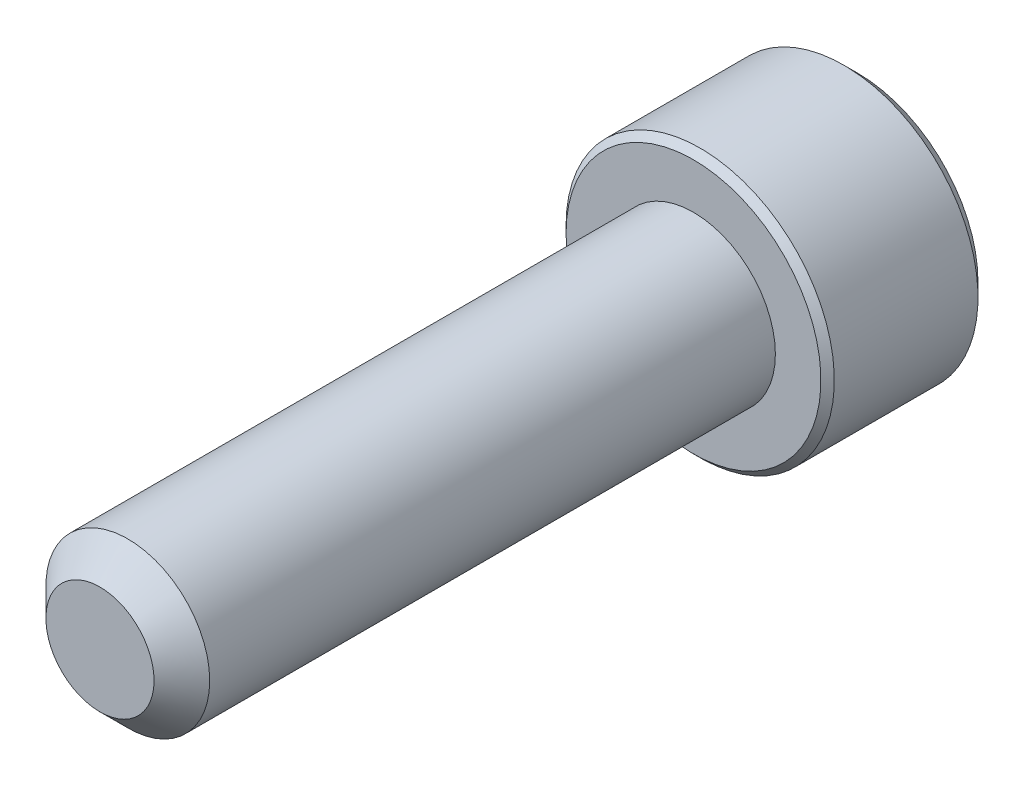
ISO-10303-21;
HEADER;
FILE_DESCRIPTION(('STEP AP214'),'2;1');
FILE_NAME('part.step','',(''),(''),'','','');
FILE_SCHEMA(('AUTOMOTIVE_DESIGN { 1 0 10303 214 1 1 1 1 }'));
ENDSEC;
DATA;
#1=APPLICATION_CONTEXT('core data for automotive mechanical design processes');
#2=APPLICATION_PROTOCOL_DEFINITION('international standard','automotive_design',2000,#1);
#3=PRODUCT_CONTEXT('',#1,'mechanical');
#4=PRODUCT('Part','Part','',(#3));
#5=PRODUCT_RELATED_PRODUCT_CATEGORY('part','',(#4));
#6=PRODUCT_DEFINITION_FORMATION('','',#4);
#7=PRODUCT_DEFINITION_CONTEXT('part definition',#1,'design');
#8=PRODUCT_DEFINITION('design','',#6,#7);
#9=PRODUCT_DEFINITION_SHAPE('','',#8);
#10=(LENGTH_UNIT() NAMED_UNIT(*) SI_UNIT(.MILLI.,.METRE.));
#11=(NAMED_UNIT(*) PLANE_ANGLE_UNIT() SI_UNIT($,.RADIAN.));
#12=(NAMED_UNIT(*) SI_UNIT($,.STERADIAN.) SOLID_ANGLE_UNIT());
#13=UNCERTAINTY_MEASURE_WITH_UNIT(LENGTH_MEASURE(1.E-05),#10,'distance_accuracy_value','');
#14=(GEOMETRIC_REPRESENTATION_CONTEXT(3) GLOBAL_UNCERTAINTY_ASSIGNED_CONTEXT((#13)) GLOBAL_UNIT_ASSIGNED_CONTEXT((#10,
#11,#12)) REPRESENTATION_CONTEXT('',''));
#15=CARTESIAN_POINT('',(0.,0.,0.));
#16=DIRECTION('',(0.,0.,1.));
#17=DIRECTION('',(1.,0.,0.));
#18=AXIS2_PLACEMENT_3D('',#15,#16,#17);
#19=CARTESIAN_POINT('',(0.,0.,-12.7));
#20=DIRECTION('',(0.,0.,1.));
#21=DIRECTION('',(1.,0.,0.));
#22=AXIS2_PLACEMENT_3D('',#19,#20,#21);
#23=CYLINDRICAL_SURFACE('',#22,1.7526);
#24=CARTESIAN_POINT('',(0.,0.,-0.595312500000002));
#25=DIRECTION('',(0.,0.,1.));
#26=DIRECTION('',(1.,0.,0.));
#27=AXIS2_PLACEMENT_3D('',#24,#25,#26);
#28=CIRCLE('',#27,1.7526);
#29=CARTESIAN_POINT('',(1.7526,0.,-0.595312500000002));
#30=VERTEX_POINT('',#29);
#31=EDGE_CURVE('E106',#30,#30,#28,.F.);
#32=ORIENTED_EDGE('',*,*,#31,.T.);
#33=EDGE_LOOP('',(#32));
#34=FACE_BOUND('',#33,.T.);
#35=CARTESIAN_POINT('',(0.,0.,-12.7));
#36=DIRECTION('',(0.,0.,-1.));
#37=DIRECTION('',(-1.,0.,0.));
#38=AXIS2_PLACEMENT_3D('',#35,#36,#37);
#39=CIRCLE('',#38,1.7526);
#40=CARTESIAN_POINT('',(-1.7526,0.,-12.7));
#41=VERTEX_POINT('',#40);
#42=EDGE_CURVE('E206',#41,#41,#39,.F.);
#43=ORIENTED_EDGE('',*,*,#42,.T.);
#44=EDGE_LOOP('',(#43));
#45=FACE_BOUND('',#44,.T.);
#46=ADVANCED_FACE('F32',(#34,#45),#23,.T.);
#47=CARTESIAN_POINT('',(0.,0.,0.));
#48=DIRECTION('',(0.,0.,1.));
#49=DIRECTION('',(1.,0.,0.));
#50=AXIS2_PLACEMENT_3D('',#47,#48,#49);
#51=PLANE('',#50);
#52=CARTESIAN_POINT('',(0.,0.,0.));
#53=DIRECTION('',(0.,0.,1.));
#54=DIRECTION('',(1.,0.,0.));
#55=AXIS2_PLACEMENT_3D('',#52,#53,#54);
#56=CIRCLE('',#55,1.1572875);
#57=CARTESIAN_POINT('',(1.1572875,0.,0.));
#58=VERTEX_POINT('',#57);
#59=EDGE_CURVE('E205',#58,#58,#56,.T.);
#60=ORIENTED_EDGE('',*,*,#59,.T.);
#61=EDGE_LOOP('',(#60));
#62=FACE_BOUND('',#61,.T.);
#63=ADVANCED_FACE('F183',(#62),#51,.T.);
#64=CARTESIAN_POINT('',(0.,0.,0.));
#65=DIRECTION('',(0.,0.,-1.));
#66=DIRECTION('',(-1.,0.,0.));
#67=AXIS2_PLACEMENT_3D('',#64,#65,#66);
#68=CONICAL_SURFACE('',#67,1.1572875,0.785398163397447);
#69=ORIENTED_EDGE('',*,*,#31,.F.);
#70=EDGE_LOOP('',(#69));
#71=FACE_BOUND('',#70,.T.);
#72=ORIENTED_EDGE('',*,*,#59,.F.);
#73=EDGE_LOOP('',(#72));
#74=FACE_BOUND('',#73,.T.);
#75=ADVANCED_FACE('F189',(#71,#74),#68,.T.);
#76=CARTESIAN_POINT('',(0.,0.,-16.2052));
#77=DIRECTION('',(0.,0.,1.));
#78=DIRECTION('',(1.,0.,0.));
#79=AXIS2_PLACEMENT_3D('',#76,#77,#78);
#80=CYLINDRICAL_SURFACE('',#79,2.8702);
#81=CARTESIAN_POINT('',(0.,0.,-12.84351));
#82=DIRECTION('',(0.,0.,-1.));
#83=DIRECTION('',(-1.,0.,0.));
#84=AXIS2_PLACEMENT_3D('',#81,#82,#83);
#85=CIRCLE('',#84,2.8702);
#86=CARTESIAN_POINT('',(-2.8702,0.,-12.84351));
#87=VERTEX_POINT('',#86);
#88=EDGE_CURVE('E40',#87,#87,#85,.T.);
#89=ORIENTED_EDGE('',*,*,#88,.T.);
#90=EDGE_LOOP('',(#89));
#91=FACE_BOUND('',#90,.T.);
#92=CARTESIAN_POINT('',(0.,0.,-15.91818));
#93=DIRECTION('',(0.,0.,-1.));
#94=DIRECTION('',(-1.,0.,0.));
#95=AXIS2_PLACEMENT_3D('',#92,#93,#94);
#96=CIRCLE('',#95,2.8702);
#97=CARTESIAN_POINT('',(-2.8702,0.,-15.91818));
#98=VERTEX_POINT('',#97);
#99=EDGE_CURVE('E166',#98,#98,#96,.F.);
#100=ORIENTED_EDGE('',*,*,#99,.T.);
#101=EDGE_LOOP('',(#100));
#102=FACE_BOUND('',#101,.T.);
#103=ADVANCED_FACE('F171',(#91,#102),#80,.T.);
#104=CARTESIAN_POINT('',(0.,0.,-16.2052));
#105=DIRECTION('',(0.,0.,-1.));
#106=DIRECTION('',(-1.,0.,0.));
#107=AXIS2_PLACEMENT_3D('',#104,#105,#106);
#108=PLANE('',#107);
#109=CARTESIAN_POINT('',(0.,0.,-16.2052));
#110=DIRECTION('',(0.,0.,-1.));
#111=DIRECTION('',(-1.,0.,0.));
#112=AXIS2_PLACEMENT_3D('',#109,#110,#111);
#113=CIRCLE('',#112,2.58318);
#114=CARTESIAN_POINT('',(-2.58318,0.,-16.2052));
#115=VERTEX_POINT('',#114);
#116=EDGE_CURVE('E105',#115,#115,#113,.T.);
#117=ORIENTED_EDGE('',*,*,#116,.T.);
#118=EDGE_LOOP('',(#117));
#119=FACE_BOUND('',#118,.T.);
#120=CARTESIAN_POINT('',(0.,0.,-16.2052));
#121=DIRECTION('',(0.,0.,-1.));
#122=DIRECTION('',(-1.,0.,0.));
#123=AXIS2_PLACEMENT_3D('',#120,#121,#122);
#124=CIRCLE('',#123,1.60395121659243);
#125=CARTESIAN_POINT('',(-1.3890625,0.801975608296215,-16.2052));
#126=VERTEX_POINT('',#125);
#127=CARTESIAN_POINT('',(0.,1.60395121659243,-16.2052));
#128=VERTEX_POINT('',#127);
#129=EDGE_CURVE('E86',#126,#128,#124,.T.);
#130=ORIENTED_EDGE('',*,*,#129,.F.);
#131=CARTESIAN_POINT('',(-1.3890625,-0.801975608296215,-16.2052));
#132=VERTEX_POINT('',#131);
#133=EDGE_CURVE('E46',#132,#126,#124,.T.);
#134=ORIENTED_EDGE('',*,*,#133,.F.);
#135=CARTESIAN_POINT('',(0.,-1.60395121659243,-16.2052));
#136=VERTEX_POINT('',#135);
#137=EDGE_CURVE('E262',#136,#132,#124,.T.);
#138=ORIENTED_EDGE('',*,*,#137,.F.);
#139=CARTESIAN_POINT('',(1.3890625,-0.801975608296214,-16.2052));
#140=VERTEX_POINT('',#139);
#141=EDGE_CURVE('E53',#140,#136,#124,.T.);
#142=ORIENTED_EDGE('',*,*,#141,.F.);
#143=CARTESIAN_POINT('',(1.3890625,0.801975608296215,-16.2052));
#144=VERTEX_POINT('',#143);
#145=EDGE_CURVE('E127',#144,#140,#124,.T.);
#146=ORIENTED_EDGE('',*,*,#145,.F.);
#147=EDGE_CURVE('E95',#128,#144,#124,.T.);
#148=ORIENTED_EDGE('',*,*,#147,.F.);
#149=EDGE_LOOP('',(#130,#134,#138,#142,#146,#148));
#150=FACE_BOUND('',#149,.T.);
#151=ADVANCED_FACE('F126',(#119,#150),#108,.T.);
#152=CARTESIAN_POINT('',(0.,0.,-12.7));
#153=DIRECTION('',(0.,0.,-1.));
#154=DIRECTION('',(-1.,0.,0.));
#155=AXIS2_PLACEMENT_3D('',#152,#153,#154);
#156=PLANE('',#155);
#157=CARTESIAN_POINT('',(0.,0.,-12.7));
#158=DIRECTION('',(0.,0.,-1.));
#159=DIRECTION('',(-1.,0.,0.));
#160=AXIS2_PLACEMENT_3D('',#157,#158,#159);
#161=CIRCLE('',#160,2.72669);
#162=CARTESIAN_POINT('',(-2.72669,0.,-12.7));
#163=VERTEX_POINT('',#162);
#164=EDGE_CURVE('E11',#163,#163,#161,.F.);
#165=ORIENTED_EDGE('',*,*,#164,.T.);
#166=EDGE_LOOP('',(#165));
#167=FACE_BOUND('',#166,.T.);
#168=ORIENTED_EDGE('',*,*,#42,.F.);
#169=EDGE_LOOP('',(#168));
#170=FACE_BOUND('',#169,.T.);
#171=ADVANCED_FACE('F274',(#167,#170),#156,.F.);
#172=CARTESIAN_POINT('',(0.,0.,-16.2052));
#173=DIRECTION('',(0.,0.,-1.));
#174=DIRECTION('',(-1.,0.,0.));
#175=AXIS2_PLACEMENT_3D('',#172,#173,#174);
#176=CONICAL_SURFACE('',#175,1.60395121659243,0.78539816339745);
#177=ORIENTED_EDGE('',*,*,#147,.T.);
#178=CARTESIAN_POINT('',(-0.000200000000000435,1.60406668664627,-16.2053154825221));
#179=CARTESIAN_POINT('',(0.0475548148995853,1.57649543140889,-16.177764786881));
#180=CARTESIAN_POINT('',(0.0961082129767672,1.54846311395896,-16.1518319141145));
#181=CARTESIAN_POINT('',(0.195114281423185,1.49130193369001,-16.1043489608708));
#182=CARTESIAN_POINT('',(0.245576372730142,1.46216763169007,-16.0828253080794));
#183=CARTESIAN_POINT('',(0.347330835284912,1.40341966534283,-16.0459546019866));
#184=CARTESIAN_POINT('',(0.398597278416378,1.37382097060048,-16.0305148513149));
#185=CARTESIAN_POINT('',(0.502259069123941,1.31397180783079,-16.0067264581829));
#186=CARTESIAN_POINT('',(0.554651247789435,1.28372316937484,-15.9983600517165));
#187=CARTESIAN_POINT('',(0.644944084544838,1.23159257576821,-15.9908113663708));
#188=CARTESIAN_POINT('',(0.682728034255604,1.20977800223165,-15.9896936971037));
#189=CARTESIAN_POINT('',(0.758229287800441,1.16618733317339,-15.9915750513552));
#190=CARTESIAN_POINT('',(0.795946575086522,1.14441124720566,-15.9945749834252));
#191=CARTESIAN_POINT('',(0.871018018906524,1.10106872890773,-16.0045189567457));
#192=CARTESIAN_POINT('',(0.908371804329557,1.07950251083849,-16.0114666704902));
#193=CARTESIAN_POINT('',(0.982452435596044,1.03673203843505,-16.0289288810594));
#194=CARTESIAN_POINT('',(1.01917900521513,1.01552794357906,-16.0394449088769));
#195=CARTESIAN_POINT('',(1.11325413716704,0.961213640822575,-16.0706664203823));
#196=CARTESIAN_POINT('',(1.17001916310317,0.928440337817792,-16.0937263608604));
#197=CARTESIAN_POINT('',(1.25348479270274,0.880251434100401,-16.1326547118294));
#198=CARTESIAN_POINT('',(1.28098915116073,0.864371785340789,-16.1463318145832));
#199=CARTESIAN_POINT('',(1.33549195495674,0.832904576897576,-16.1749348081189));
#200=CARTESIAN_POINT('',(1.36249063449213,0.817316882000056,-16.1898601023926));
#201=CARTESIAN_POINT('',(1.3892625,0.801860138242377,-16.2053154825221));
#202=B_SPLINE_CURVE_WITH_KNOTS('',3,(#178,#179,#180,#181,#182,#183,#184,#185,#186,#187,#188,
#189,#190,#191,#192,#193,#194,#195,#196,#197,#198,#199,#200,#201),.UNSPECIFIED.,.F.,.F.,(4,2,2,
2,2,2,2,2,2,2,2,4),(0.,0.185054161583334,0.37118697473197,0.554362620151557,0.737076859824678,
0.867821902366112,0.998595798526823,1.12949154907137,1.26044353188445,1.46846066168042,
1.57218026599104,1.67585058309997),.UNSPECIFIED.);
#203=EDGE_CURVE('E100',#128,#144,#202,.T.);
#204=ORIENTED_EDGE('',*,*,#203,.F.);
#205=EDGE_LOOP('',(#177,#204));
#206=FACE_BOUND('',#205,.T.);
#207=ADVANCED_FACE('F101',(#206),#176,.F.);
#208=ORIENTED_EDGE('',*,*,#145,.T.);
#209=CARTESIAN_POINT('',(1.3890625,-1.59946669533747,-16.7196888553473));
#210=CARTESIAN_POINT('',(1.3890625,-1.56052074100157,-16.6902883204447));
#211=CARTESIAN_POINT('',(1.3890625,-1.52135778101398,-16.6611760571059));
#212=CARTESIAN_POINT('',(1.3890625,-1.44250974368035,-16.6036471018554));
#213=CARTESIAN_POINT('',(1.3890625,-1.40282453775616,-16.5752305863579));
#214=CARTESIAN_POINT('',(1.3890625,-1.28227261747607,-16.4907979106091));
#215=CARTESIAN_POINT('',(1.3890625,-1.20050167441144,-16.4360513931364));
#216=CARTESIAN_POINT('',(1.3890625,-1.0290311937974,-16.3285774539605));
#217=CARTESIAN_POINT('',(1.3890625,-0.939145510476105,-16.2761436435155));
#218=CARTESIAN_POINT('',(1.3890625,-0.754884542278014,-16.1802310286316));
#219=CARTESIAN_POINT('',(1.3890625,-0.660525767721077,-16.1367220353823));
#220=CARTESIAN_POINT('',(1.3890625,-0.518892422901336,-16.0834928148428));
#221=CARTESIAN_POINT('',(1.3890625,-0.47371474679442,-16.0682156455446));
#222=CARTESIAN_POINT('',(1.3890625,-0.382268722235191,-16.0412883218985));
#223=CARTESIAN_POINT('',(1.3890625,-0.336000298881662,-16.0296384174186));
#224=CARTESIAN_POINT('',(1.3890625,-0.243422308835822,-16.0107647672582));
#225=CARTESIAN_POINT('',(1.3890625,-0.197128447486237,-16.0034651868372));
#226=CARTESIAN_POINT('',(1.3890625,-0.104045636784196,-15.993434703163));
#227=CARTESIAN_POINT('',(1.3890625,-0.057256773928491,-15.9907030145629));
#228=CARTESIAN_POINT('',(1.3890625,0.0346588401718113,-15.9900109514094));
#229=CARTESIAN_POINT('',(1.3890625,0.0797843745088195,-15.9918812460884));
#230=CARTESIAN_POINT('',(1.3890625,0.16965302260521,-15.9999168656859));
#231=CARTESIAN_POINT('',(1.3890625,0.214396061393215,-16.0060830139257));
#232=CARTESIAN_POINT('',(1.3890625,0.303926740576743,-16.0224783142406));
#233=CARTESIAN_POINT('',(1.3890625,0.348701560562638,-16.0327764230037));
#234=CARTESIAN_POINT('',(1.3890625,0.43727288980183,-16.0568883282636));
#235=CARTESIAN_POINT('',(1.3890625,0.481069480580727,-16.0707018305893));
#236=CARTESIAN_POINT('',(1.3890625,0.618958177531066,-16.1193885558667));
#237=CARTESIAN_POINT('',(1.3890625,0.711087679809603,-16.1598066296314));
#238=CARTESIAN_POINT('',(1.3890625,0.891018647016394,-16.2496712938188));
#239=CARTESIAN_POINT('',(1.3890625,0.978803075143678,-16.2991503209353));
#240=CARTESIAN_POINT('',(1.3890625,1.14657176186197,-16.4012299189673));
#241=CARTESIAN_POINT('',(1.3890625,1.22672686003424,-16.4535531888122));
#242=CARTESIAN_POINT('',(1.3890625,1.34481925924246,-16.5344395512885));
#243=CARTESIAN_POINT('',(1.3890625,1.3836737146102,-16.5616868720938));
#244=CARTESIAN_POINT('',(1.3890625,1.46085170378018,-16.6169021635328));
#245=CARTESIAN_POINT('',(1.3890625,1.49917537967344,-16.6448699353332));
#246=CARTESIAN_POINT('',(1.3890625,1.53727804285926,-16.6731364275532));
#247=B_SPLINE_CURVE_WITH_KNOTS('',3,(#209,#210,#211,#212,#213,#214,#215,#216,#217,#218,#219,
#220,#221,#222,#223,#224,#225,#226,#227,#228,#229,#230,#231,#232,#233,#234,#235,#236,#237,#238,
#239,#240,#241,#242,#243,#244,#245,#246),.UNSPECIFIED.,.F.,.F.,(4,2,2,2,2,2,2,2,2,2,2,2,2,2,2,2,
2,2,4),(0.,0.146388252251748,0.292813246205362,0.587897938676555,0.899825715593291,
1.21068031322194,1.35363178607713,1.49659310411811,1.63698331439609,1.77734938523477,
1.91262840625218,2.04793336128669,2.18559709790565,2.32324931849741,2.62418012481466,
2.92621005486572,3.2132312503121,3.35559422447358,3.49791832091463),.UNSPECIFIED.);
#248=EDGE_CURVE('E94',#144,#140,#247,.F.);
#249=ORIENTED_EDGE('',*,*,#248,.F.);
#250=EDGE_LOOP('',(#208,#249));
#251=FACE_BOUND('',#250,.T.);
#252=ADVANCED_FACE('F268',(#251),#176,.F.);
#253=ORIENTED_EDGE('',*,*,#141,.T.);
#254=CARTESIAN_POINT('',(1.3892625,-0.801860138242377,-16.2053154825221));
#255=CARTESIAN_POINT('',(1.34150768510041,-0.829431393479753,-16.177764786881));
#256=CARTESIAN_POINT('',(1.29295428702323,-0.857463710929685,-16.1518319141145));
#257=CARTESIAN_POINT('',(1.19394821857682,-0.914624891198629,-16.1043489608708));
#258=CARTESIAN_POINT('',(1.14348612726986,-0.943759193198572,-16.0828253080794));
#259=CARTESIAN_POINT('',(1.04173166471509,-1.00250715954581,-16.0459546019866));
#260=CARTESIAN_POINT('',(0.990465221583627,-1.03210585428816,-16.0305148513149));
#261=CARTESIAN_POINT('',(0.886803430876065,-1.09195501705785,-16.0067264581829));
#262=CARTESIAN_POINT('',(0.834411252210571,-1.1222036555138,-15.9983600517165));
#263=CARTESIAN_POINT('',(0.744118415455169,-1.17433424912043,-15.9908113663708));
#264=CARTESIAN_POINT('',(0.706334465744403,-1.19614882265699,-15.9896936971037));
#265=CARTESIAN_POINT('',(0.630833212199567,-1.23973949171525,-15.9915750513552));
#266=CARTESIAN_POINT('',(0.593115924913486,-1.26151557768297,-15.9945749834252));
#267=CARTESIAN_POINT('',(0.518044481093484,-1.30485809598091,-16.0045189567457));
#268=CARTESIAN_POINT('',(0.480690695670451,-1.32642431405015,-16.0114666704902));
#269=CARTESIAN_POINT('',(0.406610064403964,-1.36919478645359,-16.0289288810594));
#270=CARTESIAN_POINT('',(0.369883494784876,-1.39039888130958,-16.0394449088769));
#271=CARTESIAN_POINT('',(0.275808362832969,-1.44471318406606,-16.0706664203823));
#272=CARTESIAN_POINT('',(0.219043336896834,-1.47748648707085,-16.0937263608604));
#273=CARTESIAN_POINT('',(0.135577707297265,-1.52567539078824,-16.1326547118294));
#274=CARTESIAN_POINT('',(0.108073348839269,-1.54155503954785,-16.1463318145832));
#275=CARTESIAN_POINT('',(0.0535705450432627,-1.57302224799107,-16.1749348081189));
#276=CARTESIAN_POINT('',(0.0265718655078742,-1.58860994288859,-16.1898601023926));
#277=CARTESIAN_POINT('',(-0.000199999999998967,-1.60406668664627,-16.2053154825221));
#278=B_SPLINE_CURVE_WITH_KNOTS('',3,(#254,#255,#256,#257,#258,#259,#260,#261,#262,#263,#264,
#265,#266,#267,#268,#269,#270,#271,#272,#273,#274,#275,#276,#277),.UNSPECIFIED.,.F.,.F.,(4,2,2,
2,2,2,2,2,2,2,2,4),(0.,0.185054161583328,0.371186974731961,0.554362620151548,0.737076859824666,
0.8678219023661,0.998595798526811,1.12949154907136,1.26044353188443,1.46846066168041,
1.57218026599103,1.67585058309997),.UNSPECIFIED.);
#279=EDGE_CURVE('E136',#140,#136,#278,.T.);
#280=ORIENTED_EDGE('',*,*,#279,.F.);
#281=EDGE_LOOP('',(#253,#280));
#282=FACE_BOUND('',#281,.T.);
#283=ADVANCED_FACE('F265',(#282),#176,.F.);
#284=ORIENTED_EDGE('',*,*,#137,.T.);
#285=CARTESIAN_POINT('',(0.000200000000000775,-1.60406668664627,-16.2053154825221));
#286=CARTESIAN_POINT('',(-0.0475548148995849,-1.57649543140889,-16.177764786881));
#287=CARTESIAN_POINT('',(-0.0961082129767667,-1.54846311395896,-16.1518319141145));
#288=CARTESIAN_POINT('',(-0.195114281423184,-1.49130193369001,-16.1043489608708));
#289=CARTESIAN_POINT('',(-0.245576372730141,-1.46216763169007,-16.0828253080794));
#290=CARTESIAN_POINT('',(-0.347330835284911,-1.40341966534283,-16.0459546019866));
#291=CARTESIAN_POINT('',(-0.398597278416377,-1.37382097060048,-16.0305148513149));
#292=CARTESIAN_POINT('',(-0.50225906912394,-1.31397180783079,-16.0067264581829));
#293=CARTESIAN_POINT('',(-0.554651247789434,-1.28372316937484,-15.9983600517165));
#294=CARTESIAN_POINT('',(-0.644944084544837,-1.23159257576821,-15.9908113663708));
#295=CARTESIAN_POINT('',(-0.682728034255603,-1.20977800223165,-15.9896936971037));
#296=CARTESIAN_POINT('',(-0.75822928780044,-1.16618733317339,-15.9915750513552));
#297=CARTESIAN_POINT('',(-0.79594657508652,-1.14441124720567,-15.9945749834252));
#298=CARTESIAN_POINT('',(-0.871018018906523,-1.10106872890773,-16.0045189567457));
#299=CARTESIAN_POINT('',(-0.908371804329556,-1.07950251083849,-16.0114666704902));
#300=CARTESIAN_POINT('',(-0.982452435596043,-1.03673203843505,-16.0289288810594));
#301=CARTESIAN_POINT('',(-1.01917900521513,-1.01552794357906,-16.0394449088769));
#302=CARTESIAN_POINT('',(-1.11325413716704,-0.961213640822576,-16.0706664203823));
#303=CARTESIAN_POINT('',(-1.17001916310317,-0.928440337817793,-16.0937263608604));
#304=CARTESIAN_POINT('',(-1.25348479270274,-0.880251434100401,-16.1326547118294));
#305=CARTESIAN_POINT('',(-1.28098915116073,-0.864371785340789,-16.1463318145832));
#306=CARTESIAN_POINT('',(-1.33549195495674,-0.832904576897576,-16.1749348081189));
#307=CARTESIAN_POINT('',(-1.36249063449213,-0.817316882000055,-16.1898601023926));
#308=CARTESIAN_POINT('',(-1.3892625,-0.801860138242377,-16.2053154825221));
#309=B_SPLINE_CURVE_WITH_KNOTS('',3,(#285,#286,#287,#288,#289,#290,#291,#292,#293,#294,#295,
#296,#297,#298,#299,#300,#301,#302,#303,#304,#305,#306,#307,#308),.UNSPECIFIED.,.F.,.F.,(4,2,2,
2,2,2,2,2,2,2,2,4),(0.,0.185054161583334,0.371186974731969,0.554362620151557,0.737076859824677,
0.867821902366111,0.998595798526822,1.12949154907137,1.26044353188444,1.46846066168042,
1.57218026599104,1.67585058309997),.UNSPECIFIED.);
#310=EDGE_CURVE('E240',#136,#132,#309,.T.);
#311=ORIENTED_EDGE('',*,*,#310,.F.);
#312=EDGE_LOOP('',(#284,#311));
#313=FACE_BOUND('',#312,.T.);
#314=ADVANCED_FACE('F264',(#313),#176,.F.);
#315=ORIENTED_EDGE('',*,*,#133,.T.);
#316=CARTESIAN_POINT('',(-1.3890625,-1.59946669533747,-16.7196888553473));
#317=CARTESIAN_POINT('',(-1.3890625,-1.56052074100156,-16.6902883204447));
#318=CARTESIAN_POINT('',(-1.3890625,-1.52135778101398,-16.6611760571059));
#319=CARTESIAN_POINT('',(-1.3890625,-1.44250974368035,-16.6036471018554));
#320=CARTESIAN_POINT('',(-1.3890625,-1.40282453775616,-16.5752305863579));
#321=CARTESIAN_POINT('',(-1.3890625,-1.28227261747607,-16.4907979106091));
#322=CARTESIAN_POINT('',(-1.3890625,-1.20050167441144,-16.4360513931364));
#323=CARTESIAN_POINT('',(-1.3890625,-1.0290311937974,-16.3285774539605));
#324=CARTESIAN_POINT('',(-1.3890625,-0.939145510476104,-16.2761436435155));
#325=CARTESIAN_POINT('',(-1.3890625,-0.754884542278015,-16.1802310286316));
#326=CARTESIAN_POINT('',(-1.3890625,-0.660525767721078,-16.1367220353823));
#327=CARTESIAN_POINT('',(-1.3890625,-0.518892422901337,-16.0834928148428));
#328=CARTESIAN_POINT('',(-1.3890625,-0.47371474679442,-16.0682156455446));
#329=CARTESIAN_POINT('',(-1.3890625,-0.382268722235192,-16.0412883218985));
#330=CARTESIAN_POINT('',(-1.3890625,-0.336000298881663,-16.0296384174186));
#331=CARTESIAN_POINT('',(-1.3890625,-0.243422308835823,-16.0107647672582));
#332=CARTESIAN_POINT('',(-1.3890625,-0.197128447486237,-16.0034651868372));
#333=CARTESIAN_POINT('',(-1.3890625,-0.104045636784196,-15.993434703163));
#334=CARTESIAN_POINT('',(-1.3890625,-0.0572567739284909,-15.9907030145629));
#335=CARTESIAN_POINT('',(-1.3890625,0.0346588401718115,-15.9900109514094));
#336=CARTESIAN_POINT('',(-1.3890625,0.0797843745088197,-15.9918812460884));
#337=CARTESIAN_POINT('',(-1.3890625,0.16965302260521,-15.9999168656859));
#338=CARTESIAN_POINT('',(-1.3890625,0.214396061393215,-16.0060830139257));
#339=CARTESIAN_POINT('',(-1.3890625,0.303926740576743,-16.0224783142406));
#340=CARTESIAN_POINT('',(-1.3890625,0.348701560562639,-16.0327764230037));
#341=CARTESIAN_POINT('',(-1.3890625,0.43727288980183,-16.0568883282636));
#342=CARTESIAN_POINT('',(-1.3890625,0.481069480580728,-16.0707018305893));
#343=CARTESIAN_POINT('',(-1.3890625,0.618958177531066,-16.1193885558667));
#344=CARTESIAN_POINT('',(-1.3890625,0.711087679809604,-16.1598066296314));
#345=CARTESIAN_POINT('',(-1.3890625,0.891018647016395,-16.2496712938188));
#346=CARTESIAN_POINT('',(-1.3890625,0.978803075143678,-16.2991503209353));
#347=CARTESIAN_POINT('',(-1.3890625,1.14657176186197,-16.4012299189673));
#348=CARTESIAN_POINT('',(-1.3890625,1.22672686003424,-16.4535531888122));
#349=CARTESIAN_POINT('',(-1.3890625,1.34481925924246,-16.5344395512885));
#350=CARTESIAN_POINT('',(-1.3890625,1.3836737146102,-16.5616868720938));
#351=CARTESIAN_POINT('',(-1.3890625,1.46085170378018,-16.6169021635328));
#352=CARTESIAN_POINT('',(-1.3890625,1.49917537967343,-16.6448699353332));
#353=CARTESIAN_POINT('',(-1.3890625,1.53727804285926,-16.6731364275532));
#354=B_SPLINE_CURVE_WITH_KNOTS('',3,(#316,#317,#318,#319,#320,#321,#322,#323,#324,#325,#326,
#327,#328,#329,#330,#331,#332,#333,#334,#335,#336,#337,#338,#339,#340,#341,#342,#343,#344,#345,
#346,#347,#348,#349,#350,#351,#352,#353),.UNSPECIFIED.,.F.,.F.,(4,2,2,2,2,2,2,2,2,2,2,2,2,2,2,2,
2,2,4),(0.,0.146388252251747,0.292813246205362,0.587897938676556,0.899825715593292,
1.21068031322194,1.35363178607713,1.49659310411811,1.63698331439609,1.77734938523478,
1.91262840625218,2.04793336128669,2.18559709790565,2.32324931849741,2.62418012481466,
2.92621005486573,3.2132312503121,3.35559422447358,3.49791832091463),.UNSPECIFIED.);
#355=EDGE_CURVE('E116',#132,#126,#354,.T.);
#356=ORIENTED_EDGE('',*,*,#355,.F.);
#357=EDGE_LOOP('',(#315,#356));
#358=FACE_BOUND('',#357,.T.);
#359=ADVANCED_FACE('F281',(#358),#176,.F.);
#360=ORIENTED_EDGE('',*,*,#129,.T.);
#361=CARTESIAN_POINT('',(-1.3892625,0.801860138242378,-16.2053154825221));
#362=CARTESIAN_POINT('',(-1.34150768510041,0.829431393479754,-16.177764786881));
#363=CARTESIAN_POINT('',(-1.29295428702323,0.857463710929686,-16.1518319141145));
#364=CARTESIAN_POINT('',(-1.19394821857682,0.91462489119863,-16.1043489608708));
#365=CARTESIAN_POINT('',(-1.14348612726986,0.943759193198573,-16.0828253080794));
#366=CARTESIAN_POINT('',(-1.04173166471509,1.00250715954581,-16.0459546019866));
#367=CARTESIAN_POINT('',(-0.990465221583627,1.03210585428816,-16.0305148513149));
#368=CARTESIAN_POINT('',(-0.886803430876065,1.09195501705785,-16.0067264581829));
#369=CARTESIAN_POINT('',(-0.834411252210571,1.1222036555138,-15.9983600517165));
#370=CARTESIAN_POINT('',(-0.744118415455168,1.17433424912043,-15.9908113663708));
#371=CARTESIAN_POINT('',(-0.706334465744402,1.19614882265699,-15.9896936971037));
#372=CARTESIAN_POINT('',(-0.630833212199566,1.23973949171525,-15.9915750513552));
#373=CARTESIAN_POINT('',(-0.593115924913485,1.26151557768297,-15.9945749834252));
#374=CARTESIAN_POINT('',(-0.518044481093483,1.30485809598091,-16.0045189567457));
#375=CARTESIAN_POINT('',(-0.48069069567045,1.32642431405015,-16.0114666704902));
#376=CARTESIAN_POINT('',(-0.406610064403964,1.36919478645359,-16.0289288810594));
#377=CARTESIAN_POINT('',(-0.369883494784876,1.39039888130958,-16.0394449088769));
#378=CARTESIAN_POINT('',(-0.275808362832969,1.44471318406606,-16.0706664203823));
#379=CARTESIAN_POINT('',(-0.219043336896834,1.47748648707085,-16.0937263608604));
#380=CARTESIAN_POINT('',(-0.135577707297265,1.52567539078824,-16.1326547118294));
#381=CARTESIAN_POINT('',(-0.108073348839269,1.54155503954785,-16.1463318145832));
#382=CARTESIAN_POINT('',(-0.0535705450432612,1.57302224799107,-16.1749348081189));
#383=CARTESIAN_POINT('',(-0.0265718655078723,1.58860994288859,-16.1898601023926));
#384=CARTESIAN_POINT('',(0.000200000000000826,1.60406668664627,-16.2053154825221));
#385=B_SPLINE_CURVE_WITH_KNOTS('',3,(#361,#362,#363,#364,#365,#366,#367,#368,#369,#370,#371,
#372,#373,#374,#375,#376,#377,#378,#379,#380,#381,#382,#383,#384),.UNSPECIFIED.,.F.,.F.,(4,2,2,
2,2,2,2,2,2,2,2,4),(0.,0.185054161583329,0.371186974731961,0.554362620151548,0.737076859824666,
0.8678219023661,0.998595798526811,1.12949154907136,1.26044353188443,1.46846066168041,
1.57218026599103,1.67585058309997),.UNSPECIFIED.);
#386=EDGE_CURVE('E90',#126,#128,#385,.T.);
#387=ORIENTED_EDGE('',*,*,#386,.F.);
#388=EDGE_LOOP('',(#360,#387));
#389=FACE_BOUND('',#388,.T.);
#390=ADVANCED_FACE('F88',(#389),#176,.F.);
#391=CARTESIAN_POINT('',(1.3890625,2.40592682488864,-14.12160625));
#392=DIRECTION('',(0.,0.,-1.));
#393=DIRECTION('',(-1.,0.,0.));
#394=AXIS2_PLACEMENT_3D('',#391,#392,#393);
#395=PLANE('',#394);
#396=DIRECTION('',(0.866025403784439,0.5,0.));
#397=VECTOR('',#396,1.);
#398=CARTESIAN_POINT('',(-1.3890625,0.801975608296215,-14.12160625));
#399=LINE('',#398,#397);
#400=CARTESIAN_POINT('',(-1.3890625,0.801975608296215,-14.12160625));
#401=VERTEX_POINT('',#400);
#402=CARTESIAN_POINT('',(0.,1.60395121659243,-14.12160625));
#403=VERTEX_POINT('',#402);
#404=EDGE_CURVE('E115',#401,#403,#399,.T.);
#405=ORIENTED_EDGE('',*,*,#404,.T.);
#406=DIRECTION('',(0.866025403784439,-0.5,0.));
#407=VECTOR('',#406,1.);
#408=CARTESIAN_POINT('',(0.,1.60395121659243,-14.12160625));
#409=LINE('',#408,#407);
#410=CARTESIAN_POINT('',(1.3890625,0.801975608296215,-14.12160625));
#411=VERTEX_POINT('',#410);
#412=EDGE_CURVE('E120',#403,#411,#409,.T.);
#413=ORIENTED_EDGE('',*,*,#412,.T.);
#414=DIRECTION('',(0.,-1.,0.));
#415=VECTOR('',#414,1.);
#416=CARTESIAN_POINT('',(1.3890625,0.801975608296215,-14.12160625));
#417=LINE('',#416,#415);
#418=CARTESIAN_POINT('',(1.3890625,-0.801975608296215,-14.12160625));
#419=VERTEX_POINT('',#418);
#420=EDGE_CURVE('E228',#411,#419,#417,.T.);
#421=ORIENTED_EDGE('',*,*,#420,.T.);
#422=DIRECTION('',(-0.866025403784439,-0.5,0.));
#423=VECTOR('',#422,1.);
#424=CARTESIAN_POINT('',(1.3890625,-0.801975608296215,-14.12160625));
#425=LINE('',#424,#423);
#426=CARTESIAN_POINT('',(0.,-1.60395121659243,-14.12160625));
#427=VERTEX_POINT('',#426);
#428=EDGE_CURVE('E225',#419,#427,#425,.T.);
#429=ORIENTED_EDGE('',*,*,#428,.T.);
#430=DIRECTION('',(-0.866025403784439,0.5,0.));
#431=VECTOR('',#430,1.);
#432=CARTESIAN_POINT('',(0.,-1.60395121659243,-14.12160625));
#433=LINE('',#432,#431);
#434=CARTESIAN_POINT('',(-1.3890625,-0.801975608296215,-14.12160625));
#435=VERTEX_POINT('',#434);
#436=EDGE_CURVE('E222',#427,#435,#433,.T.);
#437=ORIENTED_EDGE('',*,*,#436,.T.);
#438=DIRECTION('',(0.,1.,0.));
#439=VECTOR('',#438,1.);
#440=CARTESIAN_POINT('',(-1.3890625,-0.801975608296215,-14.12160625));
#441=LINE('',#440,#439);
#442=EDGE_CURVE('E123',#435,#401,#441,.T.);
#443=ORIENTED_EDGE('',*,*,#442,.T.);
#444=EDGE_LOOP('',(#405,#413,#421,#429,#437,#443));
#445=FACE_BOUND('',#444,.T.);
#446=ADVANCED_FACE('F155',(#445),#395,.T.);
#447=CARTESIAN_POINT('',(0.,1.60395121659243,-14.12160625));
#448=DIRECTION('',(0.5,0.866025403784439,0.));
#449=DIRECTION('',(-0.866025403784439,0.5,0.));
#450=AXIS2_PLACEMENT_3D('',#447,#448,#449);
#451=PLANE('',#450);
#452=DIRECTION('',(0.,0.,-1.));
#453=VECTOR('',#452,1.);
#454=CARTESIAN_POINT('',(0.,1.60395121659243,-14.12160625));
#455=LINE('',#454,#453);
#456=EDGE_CURVE('E112',#403,#128,#455,.T.);
#457=ORIENTED_EDGE('',*,*,#456,.T.);
#458=ORIENTED_EDGE('',*,*,#203,.T.);
#459=DIRECTION('',(0.,0.,-1.));
#460=VECTOR('',#459,1.);
#461=CARTESIAN_POINT('',(1.3890625,0.801975608296215,-14.12160625));
#462=LINE('',#461,#460);
#463=EDGE_CURVE('E122',#411,#144,#462,.T.);
#464=ORIENTED_EDGE('',*,*,#463,.F.);
#465=ORIENTED_EDGE('',*,*,#412,.F.);
#466=EDGE_LOOP('',(#457,#458,#464,#465));
#467=FACE_BOUND('',#466,.T.);
#468=ADVANCED_FACE('F118',(#467),#451,.F.);
#469=CARTESIAN_POINT('',(1.3890625,0.801975608296215,-14.12160625));
#470=DIRECTION('',(1.,0.,0.));
#471=DIRECTION('',(0.,1.,0.));
#472=AXIS2_PLACEMENT_3D('',#469,#470,#471);
#473=PLANE('',#472);
#474=ORIENTED_EDGE('',*,*,#463,.T.);
#475=ORIENTED_EDGE('',*,*,#248,.T.);
#476=DIRECTION('',(0.,0.,-1.));
#477=VECTOR('',#476,1.);
#478=CARTESIAN_POINT('',(1.3890625,-0.801975608296215,-14.12160625));
#479=LINE('',#478,#477);
#480=EDGE_CURVE('E211',#419,#140,#479,.T.);
#481=ORIENTED_EDGE('',*,*,#480,.F.);
#482=ORIENTED_EDGE('',*,*,#420,.F.);
#483=EDGE_LOOP('',(#474,#475,#481,#482));
#484=FACE_BOUND('',#483,.T.);
#485=ADVANCED_FACE('F144',(#484),#473,.F.);
#486=CARTESIAN_POINT('',(1.3890625,-0.801975608296215,-14.12160625));
#487=DIRECTION('',(0.5,-0.866025403784439,0.));
#488=DIRECTION('',(0.866025403784439,0.5,0.));
#489=AXIS2_PLACEMENT_3D('',#486,#487,#488);
#490=PLANE('',#489);
#491=ORIENTED_EDGE('',*,*,#480,.T.);
#492=ORIENTED_EDGE('',*,*,#279,.T.);
#493=DIRECTION('',(0.,0.,-1.));
#494=VECTOR('',#493,1.);
#495=CARTESIAN_POINT('',(0.,-1.60395121659243,-14.12160625));
#496=LINE('',#495,#494);
#497=EDGE_CURVE('E214',#427,#136,#496,.T.);
#498=ORIENTED_EDGE('',*,*,#497,.F.);
#499=ORIENTED_EDGE('',*,*,#428,.F.);
#500=EDGE_LOOP('',(#491,#492,#498,#499));
#501=FACE_BOUND('',#500,.T.);
#502=ADVANCED_FACE('F148',(#501),#490,.F.);
#503=CARTESIAN_POINT('',(0.,-1.60395121659243,-14.12160625));
#504=DIRECTION('',(-0.5,-0.866025403784439,0.));
#505=DIRECTION('',(0.866025403784439,-0.5,0.));
#506=AXIS2_PLACEMENT_3D('',#503,#504,#505);
#507=PLANE('',#506);
#508=ORIENTED_EDGE('',*,*,#497,.T.);
#509=ORIENTED_EDGE('',*,*,#310,.T.);
#510=DIRECTION('',(0.,0.,-1.));
#511=VECTOR('',#510,1.);
#512=CARTESIAN_POINT('',(-1.3890625,-0.801975608296215,-14.12160625));
#513=LINE('',#512,#511);
#514=EDGE_CURVE('E217',#435,#132,#513,.T.);
#515=ORIENTED_EDGE('',*,*,#514,.F.);
#516=ORIENTED_EDGE('',*,*,#436,.F.);
#517=EDGE_LOOP('',(#508,#509,#515,#516));
#518=FACE_BOUND('',#517,.T.);
#519=ADVANCED_FACE('F247',(#518),#507,.F.);
#520=CARTESIAN_POINT('',(-1.3890625,-0.801975608296215,-14.12160625));
#521=DIRECTION('',(-1.,0.,0.));
#522=DIRECTION('',(0.,-1.,0.));
#523=AXIS2_PLACEMENT_3D('',#520,#521,#522);
#524=PLANE('',#523);
#525=ORIENTED_EDGE('',*,*,#514,.T.);
#526=ORIENTED_EDGE('',*,*,#355,.T.);
#527=DIRECTION('',(0.,0.,-1.));
#528=VECTOR('',#527,1.);
#529=CARTESIAN_POINT('',(-1.3890625,0.801975608296215,-14.12160625));
#530=LINE('',#529,#528);
#531=EDGE_CURVE('E114',#401,#126,#530,.T.);
#532=ORIENTED_EDGE('',*,*,#531,.F.);
#533=ORIENTED_EDGE('',*,*,#442,.F.);
#534=EDGE_LOOP('',(#525,#526,#532,#533));
#535=FACE_BOUND('',#534,.T.);
#536=ADVANCED_FACE('F244',(#535),#524,.F.);
#537=CARTESIAN_POINT('',(-1.3890625,0.801975608296215,-14.12160625));
#538=DIRECTION('',(-0.5,0.866025403784439,0.));
#539=DIRECTION('',(-0.866025403784439,-0.5,0.));
#540=AXIS2_PLACEMENT_3D('',#537,#538,#539);
#541=PLANE('',#540);
#542=ORIENTED_EDGE('',*,*,#531,.T.);
#543=ORIENTED_EDGE('',*,*,#386,.T.);
#544=ORIENTED_EDGE('',*,*,#456,.F.);
#545=ORIENTED_EDGE('',*,*,#404,.F.);
#546=EDGE_LOOP('',(#542,#543,#544,#545));
#547=FACE_BOUND('',#546,.T.);
#548=ADVANCED_FACE('F110',(#547),#541,.F.);
#549=CARTESIAN_POINT('',(0.,0.,-16.2052));
#550=DIRECTION('',(0.,0.,1.));
#551=DIRECTION('',(1.,0.,0.));
#552=AXIS2_PLACEMENT_3D('',#549,#550,#551);
#553=CONICAL_SURFACE('',#552,2.58318,0.785398163397451);
#554=ORIENTED_EDGE('',*,*,#99,.F.);
#555=EDGE_LOOP('',(#554));
#556=FACE_BOUND('',#555,.T.);
#557=ORIENTED_EDGE('',*,*,#116,.F.);
#558=EDGE_LOOP('',(#557));
#559=FACE_BOUND('',#558,.T.);
#560=ADVANCED_FACE('F175',(#556,#559),#553,.T.);
#561=CARTESIAN_POINT('',(0.,0.,-12.84351));
#562=DIRECTION('',(0.,0.,-1.));
#563=DIRECTION('',(-1.,0.,0.));
#564=AXIS2_PLACEMENT_3D('',#561,#562,#563);
#565=CONICAL_SURFACE('',#564,2.8702,0.785398163397447);
#566=ORIENTED_EDGE('',*,*,#164,.F.);
#567=EDGE_LOOP('',(#566));
#568=FACE_BOUND('',#567,.T.);
#569=ORIENTED_EDGE('',*,*,#88,.F.);
#570=EDGE_LOOP('',(#569));
#571=FACE_BOUND('',#570,.T.);
#572=ADVANCED_FACE('F34',(#568,#571),#565,.T.);
#573=CLOSED_SHELL('',(#46,#63,#75,#103,#151,#171,#207,#252,#283,#314,#359,#390,#446,#468,#485,
#502,#519,#536,#548,#560,#572));
#574=MANIFOLD_SOLID_BREP('B2',#573);
#575=ADVANCED_BREP_SHAPE_REPRESENTATION('',(#18,#574),#14);
#576=SHAPE_DEFINITION_REPRESENTATION(#9,#575);
ENDSEC;
END-ISO-10303-21;
